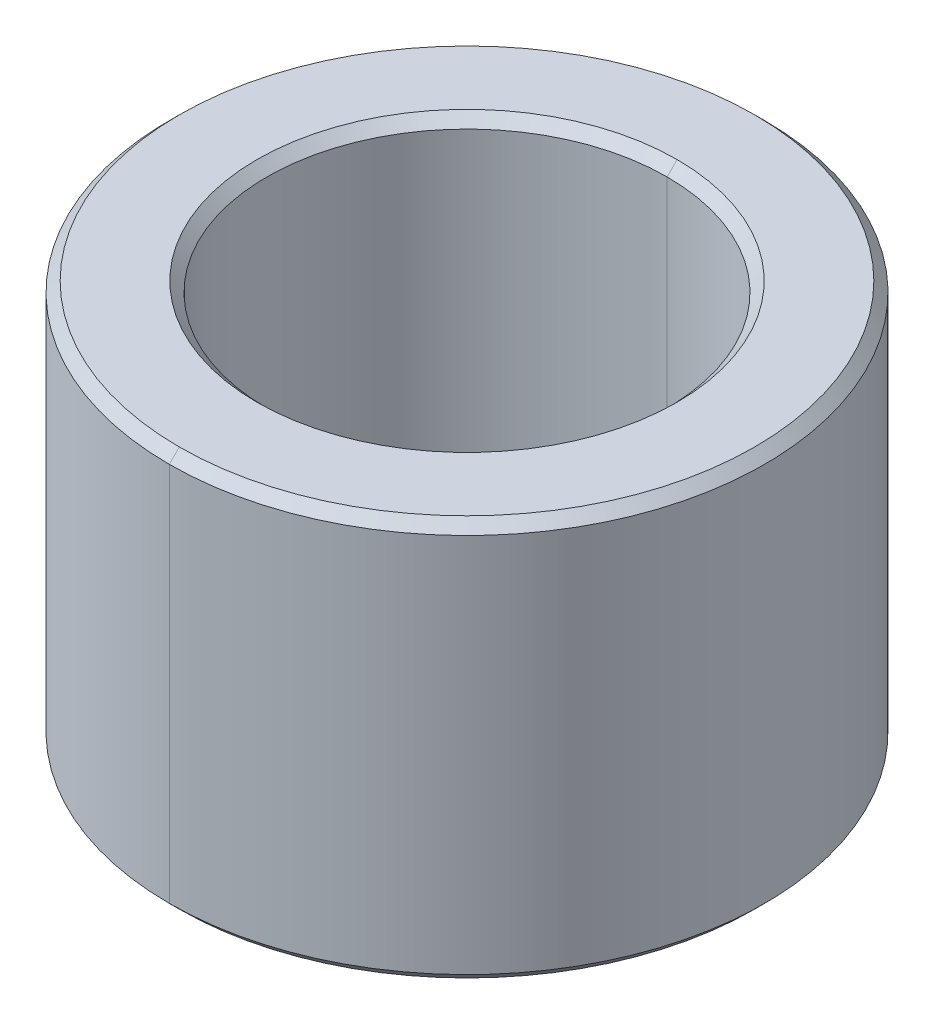
ISO-10303-21;
HEADER;
FILE_DESCRIPTION(('STEP AP214'),'2;1');
FILE_NAME('part.step','',(''),(''),'','','');
FILE_SCHEMA(('AUTOMOTIVE_DESIGN { 1 0 10303 214 1 1 1 1 }'));
ENDSEC;
DATA;
#1=APPLICATION_CONTEXT('core data for automotive mechanical design processes');
#2=APPLICATION_PROTOCOL_DEFINITION('international standard','automotive_design',2000,#1);
#3=PRODUCT_CONTEXT('',#1,'mechanical');
#4=PRODUCT('Part','Part','',(#3));
#5=PRODUCT_RELATED_PRODUCT_CATEGORY('part','',(#4));
#6=PRODUCT_DEFINITION_FORMATION('','',#4);
#7=PRODUCT_DEFINITION_CONTEXT('part definition',#1,'design');
#8=PRODUCT_DEFINITION('design','',#6,#7);
#9=PRODUCT_DEFINITION_SHAPE('','',#8);
#10=(LENGTH_UNIT() NAMED_UNIT(*) SI_UNIT(.MILLI.,.METRE.));
#11=(NAMED_UNIT(*) PLANE_ANGLE_UNIT() SI_UNIT($,.RADIAN.));
#12=(NAMED_UNIT(*) SI_UNIT($,.STERADIAN.) SOLID_ANGLE_UNIT());
#13=UNCERTAINTY_MEASURE_WITH_UNIT(LENGTH_MEASURE(1.E-05),#10,'distance_accuracy_value','');
#14=(GEOMETRIC_REPRESENTATION_CONTEXT(3) GLOBAL_UNCERTAINTY_ASSIGNED_CONTEXT((#13)) GLOBAL_UNIT_ASSIGNED_CONTEXT((#10,
#11,#12)) REPRESENTATION_CONTEXT('',''));
#15=CARTESIAN_POINT('',(0.,0.,0.));
#16=DIRECTION('',(0.,0.,1.));
#17=DIRECTION('',(1.,0.,0.));
#18=AXIS2_PLACEMENT_3D('',#15,#16,#17);
#19=CARTESIAN_POINT('',(0.,1.9,0.));
#20=DIRECTION('',(0.,1.,0.));
#21=DIRECTION('',(0.,0.,1.));
#22=AXIS2_PLACEMENT_3D('',#19,#20,#21);
#23=CONICAL_SURFACE('',#22,2.,0.785398163397455);
#24=DIRECTION('',(0.,0.707106781186543,-0.707106781186552));
#25=VECTOR('',#24,1.);
#26=CARTESIAN_POINT('',(0.,1.9,-2.));
#27=LINE('',#26,#25);
#28=CARTESIAN_POINT('',(0.,1.9,-2.));
#29=VERTEX_POINT('',#28);
#30=CARTESIAN_POINT('',(0.,2.,-2.1));
#31=VERTEX_POINT('',#30);
#32=EDGE_CURVE('E171',#29,#31,#27,.T.);
#33=ORIENTED_EDGE('',*,*,#32,.F.);
#34=CARTESIAN_POINT('',(0.,1.9,0.));
#35=DIRECTION('',(0.,1.,0.));
#36=DIRECTION('',(0.,0.,1.));
#37=AXIS2_PLACEMENT_3D('',#34,#35,#36);
#38=CIRCLE('',#37,2.);
#39=CARTESIAN_POINT('',(0.,1.9,2.));
#40=VERTEX_POINT('',#39);
#41=EDGE_CURVE('E25',#40,#29,#38,.T.);
#42=ORIENTED_EDGE('',*,*,#41,.F.);
#43=DIRECTION('',(0.,0.707106781186543,0.707106781186552));
#44=VECTOR('',#43,1.);
#45=CARTESIAN_POINT('',(0.,1.9,2.));
#46=LINE('',#45,#44);
#47=CARTESIAN_POINT('',(0.,2.,2.1));
#48=VERTEX_POINT('',#47);
#49=EDGE_CURVE('E149',#40,#48,#46,.T.);
#50=ORIENTED_EDGE('',*,*,#49,.T.);
#51=CARTESIAN_POINT('',(0.,2.,0.));
#52=DIRECTION('',(0.,-1.,0.));
#53=DIRECTION('',(0.,0.,1.));
#54=AXIS2_PLACEMENT_3D('',#51,#52,#53);
#55=CIRCLE('',#54,2.1);
#56=EDGE_CURVE('E167',#31,#48,#55,.T.);
#57=ORIENTED_EDGE('',*,*,#56,.F.);
#58=EDGE_LOOP('',(#33,#42,#50,#57));
#59=FACE_BOUND('',#58,.T.);
#60=ADVANCED_FACE('F14',(#59),#23,.F.);
#61=CARTESIAN_POINT('',(0.,-2.,0.));
#62=DIRECTION('',(0.,-1.,0.));
#63=DIRECTION('',(0.,0.,-1.));
#64=AXIS2_PLACEMENT_3D('',#61,#62,#63);
#65=CONICAL_SURFACE('',#64,2.1,0.785398163397443);
#66=DIRECTION('',(0.,-0.707106781186551,0.707106781186545));
#67=VECTOR('',#66,1.);
#68=CARTESIAN_POINT('',(0.,-2.,2.1));
#69=LINE('',#68,#67);
#70=CARTESIAN_POINT('',(0.,-1.9,2.));
#71=VERTEX_POINT('',#70);
#72=CARTESIAN_POINT('',(0.,-2.,2.1));
#73=VERTEX_POINT('',#72);
#74=EDGE_CURVE('E176',#71,#73,#69,.T.);
#75=ORIENTED_EDGE('',*,*,#74,.F.);
#76=CARTESIAN_POINT('',(0.,-1.9,0.));
#77=DIRECTION('',(0.,-1.,0.));
#78=DIRECTION('',(0.,0.,1.));
#79=AXIS2_PLACEMENT_3D('',#76,#77,#78);
#80=CIRCLE('',#79,2.);
#81=CARTESIAN_POINT('',(0.,-1.9,-2.));
#82=VERTEX_POINT('',#81);
#83=EDGE_CURVE('E9',#82,#71,#80,.T.);
#84=ORIENTED_EDGE('',*,*,#83,.F.);
#85=DIRECTION('',(0.,-0.707106781186551,-0.707106781186545));
#86=VECTOR('',#85,1.);
#87=CARTESIAN_POINT('',(0.,-2.,-2.1));
#88=LINE('',#87,#86);
#89=CARTESIAN_POINT('',(0.,-2.,-2.1));
#90=VERTEX_POINT('',#89);
#91=EDGE_CURVE('E141',#82,#90,#88,.T.);
#92=ORIENTED_EDGE('',*,*,#91,.T.);
#93=CARTESIAN_POINT('',(0.,-2.,0.));
#94=DIRECTION('',(0.,1.,0.));
#95=DIRECTION('',(0.,0.,1.));
#96=AXIS2_PLACEMENT_3D('',#93,#94,#95);
#97=CIRCLE('',#96,2.1);
#98=EDGE_CURVE('E116',#73,#90,#97,.T.);
#99=ORIENTED_EDGE('',*,*,#98,.F.);
#100=EDGE_LOOP('',(#75,#84,#92,#99));
#101=FACE_BOUND('',#100,.T.);
#102=ADVANCED_FACE('F219',(#101),#65,.F.);
#103=CARTESIAN_POINT('',(0.,2.,0.));
#104=DIRECTION('',(0.,-1.,0.));
#105=DIRECTION('',(0.,0.,-1.));
#106=AXIS2_PLACEMENT_3D('',#103,#104,#105);
#107=CONICAL_SURFACE('',#106,2.875,0.785398163397452);
#108=DIRECTION('',(0.,-0.707106781186545,0.707106781186551));
#109=VECTOR('',#108,1.);
#110=CARTESIAN_POINT('',(0.,2.,2.875));
#111=LINE('',#110,#109);
#112=CARTESIAN_POINT('',(0.,2.,2.875));
#113=VERTEX_POINT('',#112);
#114=CARTESIAN_POINT('',(0.,1.9,2.975));
#115=VERTEX_POINT('',#114);
#116=EDGE_CURVE('E109',#113,#115,#111,.T.);
#117=ORIENTED_EDGE('',*,*,#116,.F.);
#118=CARTESIAN_POINT('',(0.,2.,0.));
#119=DIRECTION('',(0.,1.,0.));
#120=DIRECTION('',(0.,0.,1.));
#121=AXIS2_PLACEMENT_3D('',#118,#119,#120);
#122=CIRCLE('',#121,2.875);
#123=CARTESIAN_POINT('',(0.,2.,-2.875));
#124=VERTEX_POINT('',#123);
#125=EDGE_CURVE('E148',#124,#113,#122,.T.);
#126=ORIENTED_EDGE('',*,*,#125,.F.);
#127=DIRECTION('',(0.,-0.707106781186545,-0.707106781186551));
#128=VECTOR('',#127,1.);
#129=CARTESIAN_POINT('',(0.,2.,-2.875));
#130=LINE('',#129,#128);
#131=CARTESIAN_POINT('',(0.,1.9,-2.975));
#132=VERTEX_POINT('',#131);
#133=EDGE_CURVE('E112',#124,#132,#130,.T.);
#134=ORIENTED_EDGE('',*,*,#133,.T.);
#135=CARTESIAN_POINT('',(0.,1.9,0.));
#136=DIRECTION('',(0.,-1.,0.));
#137=DIRECTION('',(0.,0.,1.));
#138=AXIS2_PLACEMENT_3D('',#135,#136,#137);
#139=CIRCLE('',#138,2.975);
#140=EDGE_CURVE('E107',#115,#132,#139,.T.);
#141=ORIENTED_EDGE('',*,*,#140,.F.);
#142=EDGE_LOOP('',(#117,#126,#134,#141));
#143=FACE_BOUND('',#142,.T.);
#144=ADVANCED_FACE('F16',(#143),#107,.T.);
#145=CARTESIAN_POINT('',(0.,-1.9,0.));
#146=DIRECTION('',(0.,1.,0.));
#147=DIRECTION('',(0.,0.,1.));
#148=AXIS2_PLACEMENT_3D('',#145,#146,#147);
#149=CONICAL_SURFACE('',#148,2.975,0.78539816339745);
#150=DIRECTION('',(0.,0.707106781186546,-0.707106781186549));
#151=VECTOR('',#150,1.);
#152=CARTESIAN_POINT('',(0.,-1.9,-2.975));
#153=LINE('',#152,#151);
#154=CARTESIAN_POINT('',(0.,-2.,-2.875));
#155=VERTEX_POINT('',#154);
#156=CARTESIAN_POINT('',(0.,-1.9,-2.975));
#157=VERTEX_POINT('',#156);
#158=EDGE_CURVE('E187',#155,#157,#153,.T.);
#159=ORIENTED_EDGE('',*,*,#158,.F.);
#160=CARTESIAN_POINT('',(0.,-2.,0.));
#161=DIRECTION('',(0.,-1.,0.));
#162=DIRECTION('',(0.,0.,1.));
#163=AXIS2_PLACEMENT_3D('',#160,#161,#162);
#164=CIRCLE('',#163,2.875);
#165=CARTESIAN_POINT('',(0.,-2.,2.875));
#166=VERTEX_POINT('',#165);
#167=EDGE_CURVE('E63',#166,#155,#164,.T.);
#168=ORIENTED_EDGE('',*,*,#167,.F.);
#169=DIRECTION('',(0.,0.707106781186546,0.707106781186549));
#170=VECTOR('',#169,1.);
#171=CARTESIAN_POINT('',(0.,-1.9,2.975));
#172=LINE('',#171,#170);
#173=CARTESIAN_POINT('',(0.,-1.9,2.975));
#174=VERTEX_POINT('',#173);
#175=EDGE_CURVE('E157',#166,#174,#172,.T.);
#176=ORIENTED_EDGE('',*,*,#175,.T.);
#177=CARTESIAN_POINT('',(0.,-1.9,0.));
#178=DIRECTION('',(0.,1.,0.));
#179=DIRECTION('',(0.,0.,1.));
#180=AXIS2_PLACEMENT_3D('',#177,#178,#179);
#181=CIRCLE('',#180,2.975);
#182=EDGE_CURVE('E40',#157,#174,#181,.T.);
#183=ORIENTED_EDGE('',*,*,#182,.F.);
#184=EDGE_LOOP('',(#159,#168,#176,#183));
#185=FACE_BOUND('',#184,.T.);
#186=ADVANCED_FACE('F199',(#185),#149,.T.);
#187=CARTESIAN_POINT('',(0.,2.,0.));
#188=DIRECTION('',(0.,-1.,0.));
#189=DIRECTION('',(0.,0.,-1.));
#190=AXIS2_PLACEMENT_3D('',#187,#188,#189);
#191=CYLINDRICAL_SURFACE('',#190,2.);
#192=DIRECTION('',(0.,-1.,0.));
#193=VECTOR('',#192,1.);
#194=CARTESIAN_POINT('',(0.,2.,2.));
#195=LINE('',#194,#193);
#196=EDGE_CURVE('E160',#40,#71,#195,.T.);
#197=ORIENTED_EDGE('',*,*,#196,.F.);
#198=ORIENTED_EDGE('',*,*,#41,.T.);
#199=DIRECTION('',(0.,-1.,0.));
#200=VECTOR('',#199,1.);
#201=CARTESIAN_POINT('',(0.,2.,-2.));
#202=LINE('',#201,#200);
#203=EDGE_CURVE('E18',#29,#82,#202,.T.);
#204=ORIENTED_EDGE('',*,*,#203,.T.);
#205=ORIENTED_EDGE('',*,*,#83,.T.);
#206=EDGE_LOOP('',(#197,#198,#204,#205));
#207=FACE_BOUND('',#206,.T.);
#208=ADVANCED_FACE('F236',(#207),#191,.F.);
#209=CARTESIAN_POINT('',(0.,2.,0.));
#210=DIRECTION('',(0.,-1.,0.));
#211=DIRECTION('',(0.,0.,-1.));
#212=AXIS2_PLACEMENT_3D('',#209,#210,#211);
#213=CYLINDRICAL_SURFACE('',#212,2.975);
#214=DIRECTION('',(0.,-1.,0.));
#215=VECTOR('',#214,1.);
#216=CARTESIAN_POINT('',(0.,2.,2.975));
#217=LINE('',#216,#215);
#218=EDGE_CURVE('E118',#115,#174,#217,.T.);
#219=ORIENTED_EDGE('',*,*,#218,.F.);
#220=ORIENTED_EDGE('',*,*,#140,.T.);
#221=DIRECTION('',(0.,-1.,0.));
#222=VECTOR('',#221,1.);
#223=CARTESIAN_POINT('',(0.,2.,-2.975));
#224=LINE('',#223,#222);
#225=EDGE_CURVE('E124',#132,#157,#224,.T.);
#226=ORIENTED_EDGE('',*,*,#225,.T.);
#227=ORIENTED_EDGE('',*,*,#182,.T.);
#228=EDGE_LOOP('',(#219,#220,#226,#227));
#229=FACE_BOUND('',#228,.T.);
#230=ADVANCED_FACE('F120',(#229),#213,.T.);
#231=CARTESIAN_POINT('',(0.,-2.,0.));
#232=DIRECTION('',(0.,1.,0.));
#233=DIRECTION('',(1.,0.,0.));
#234=AXIS2_PLACEMENT_3D('',#231,#232,#233);
#235=PLANE('',#234);
#236=CARTESIAN_POINT('',(0.,-2.,0.));
#237=DIRECTION('',(0.,1.,0.));
#238=DIRECTION('',(0.,0.,1.));
#239=AXIS2_PLACEMENT_3D('',#236,#237,#238);
#240=CIRCLE('',#239,2.1);
#241=EDGE_CURVE('E207',#90,#73,#240,.T.);
#242=ORIENTED_EDGE('',*,*,#241,.T.);
#243=ORIENTED_EDGE('',*,*,#98,.T.);
#244=EDGE_LOOP('',(#242,#243));
#245=FACE_BOUND('',#244,.T.);
#246=ORIENTED_EDGE('',*,*,#167,.T.);
#247=CARTESIAN_POINT('',(0.,-2.,0.));
#248=DIRECTION('',(0.,-1.,0.));
#249=DIRECTION('',(0.,0.,1.));
#250=AXIS2_PLACEMENT_3D('',#247,#248,#249);
#251=CIRCLE('',#250,2.875);
#252=EDGE_CURVE('E181',#155,#166,#251,.T.);
#253=ORIENTED_EDGE('',*,*,#252,.T.);
#254=EDGE_LOOP('',(#246,#253));
#255=FACE_BOUND('',#254,.T.);
#256=ADVANCED_FACE('F195',(#245,#255),#235,.F.);
#257=CARTESIAN_POINT('',(0.,2.,0.));
#258=DIRECTION('',(0.,1.,0.));
#259=DIRECTION('',(1.,0.,0.));
#260=AXIS2_PLACEMENT_3D('',#257,#258,#259);
#261=PLANE('',#260);
#262=CARTESIAN_POINT('',(0.,2.,0.));
#263=DIRECTION('',(0.,-1.,0.));
#264=DIRECTION('',(0.,0.,1.));
#265=AXIS2_PLACEMENT_3D('',#262,#263,#264);
#266=CIRCLE('',#265,2.1);
#267=EDGE_CURVE('E145',#48,#31,#266,.T.);
#268=ORIENTED_EDGE('',*,*,#267,.T.);
#269=ORIENTED_EDGE('',*,*,#56,.T.);
#270=EDGE_LOOP('',(#268,#269));
#271=FACE_BOUND('',#270,.T.);
#272=ORIENTED_EDGE('',*,*,#125,.T.);
#273=CARTESIAN_POINT('',(0.,2.,0.));
#274=DIRECTION('',(0.,1.,0.));
#275=DIRECTION('',(0.,0.,1.));
#276=AXIS2_PLACEMENT_3D('',#273,#274,#275);
#277=CIRCLE('',#276,2.875);
#278=EDGE_CURVE('E133',#113,#124,#277,.T.);
#279=ORIENTED_EDGE('',*,*,#278,.T.);
#280=EDGE_LOOP('',(#272,#279));
#281=FACE_BOUND('',#280,.T.);
#282=ADVANCED_FACE('F227',(#271,#281),#261,.T.);
#283=CARTESIAN_POINT('',(0.,2.,0.));
#284=DIRECTION('',(0.,-1.,0.));
#285=DIRECTION('',(0.,0.,-1.));
#286=AXIS2_PLACEMENT_3D('',#283,#284,#285);
#287=CYLINDRICAL_SURFACE('',#286,2.975);
#288=CARTESIAN_POINT('',(0.,1.9,0.));
#289=DIRECTION('',(0.,-1.,0.));
#290=DIRECTION('',(0.,0.,1.));
#291=AXIS2_PLACEMENT_3D('',#288,#289,#290);
#292=CIRCLE('',#291,2.975);
#293=EDGE_CURVE('E126',#132,#115,#292,.T.);
#294=ORIENTED_EDGE('',*,*,#293,.T.);
#295=ORIENTED_EDGE('',*,*,#218,.T.);
#296=CARTESIAN_POINT('',(0.,-1.9,0.));
#297=DIRECTION('',(0.,1.,0.));
#298=DIRECTION('',(0.,0.,1.));
#299=AXIS2_PLACEMENT_3D('',#296,#297,#298);
#300=CIRCLE('',#299,2.975);
#301=EDGE_CURVE('E161',#174,#157,#300,.T.);
#302=ORIENTED_EDGE('',*,*,#301,.T.);
#303=ORIENTED_EDGE('',*,*,#225,.F.);
#304=EDGE_LOOP('',(#294,#295,#302,#303));
#305=FACE_BOUND('',#304,.T.);
#306=ADVANCED_FACE('F127',(#305),#287,.T.);
#307=CARTESIAN_POINT('',(0.,2.,0.));
#308=DIRECTION('',(0.,-1.,0.));
#309=DIRECTION('',(0.,0.,-1.));
#310=AXIS2_PLACEMENT_3D('',#307,#308,#309);
#311=CYLINDRICAL_SURFACE('',#310,2.);
#312=CARTESIAN_POINT('',(0.,1.9,0.));
#313=DIRECTION('',(0.,1.,0.));
#314=DIRECTION('',(0.,0.,1.));
#315=AXIS2_PLACEMENT_3D('',#312,#313,#314);
#316=CIRCLE('',#315,2.);
#317=EDGE_CURVE('E168',#29,#40,#316,.T.);
#318=ORIENTED_EDGE('',*,*,#317,.T.);
#319=ORIENTED_EDGE('',*,*,#196,.T.);
#320=CARTESIAN_POINT('',(0.,-1.9,0.));
#321=DIRECTION('',(0.,-1.,0.));
#322=DIRECTION('',(0.,0.,1.));
#323=AXIS2_PLACEMENT_3D('',#320,#321,#322);
#324=CIRCLE('',#323,2.);
#325=EDGE_CURVE('E153',#71,#82,#324,.T.);
#326=ORIENTED_EDGE('',*,*,#325,.T.);
#327=ORIENTED_EDGE('',*,*,#203,.F.);
#328=EDGE_LOOP('',(#318,#319,#326,#327));
#329=FACE_BOUND('',#328,.T.);
#330=ADVANCED_FACE('F258',(#329),#311,.F.);
#331=CARTESIAN_POINT('',(0.,-1.9,0.));
#332=DIRECTION('',(0.,1.,0.));
#333=DIRECTION('',(0.,0.,1.));
#334=AXIS2_PLACEMENT_3D('',#331,#332,#333);
#335=CONICAL_SURFACE('',#334,2.975,0.78539816339745);
#336=ORIENTED_EDGE('',*,*,#252,.F.);
#337=ORIENTED_EDGE('',*,*,#158,.T.);
#338=ORIENTED_EDGE('',*,*,#301,.F.);
#339=ORIENTED_EDGE('',*,*,#175,.F.);
#340=EDGE_LOOP('',(#336,#337,#338,#339));
#341=FACE_BOUND('',#340,.T.);
#342=ADVANCED_FACE('F197',(#341),#335,.T.);
#343=CARTESIAN_POINT('',(0.,2.,0.));
#344=DIRECTION('',(0.,-1.,0.));
#345=DIRECTION('',(0.,0.,-1.));
#346=AXIS2_PLACEMENT_3D('',#343,#344,#345);
#347=CONICAL_SURFACE('',#346,2.875,0.785398163397452);
#348=ORIENTED_EDGE('',*,*,#278,.F.);
#349=ORIENTED_EDGE('',*,*,#116,.T.);
#350=ORIENTED_EDGE('',*,*,#293,.F.);
#351=ORIENTED_EDGE('',*,*,#133,.F.);
#352=EDGE_LOOP('',(#348,#349,#350,#351));
#353=FACE_BOUND('',#352,.T.);
#354=ADVANCED_FACE('F131',(#353),#347,.T.);
#355=CARTESIAN_POINT('',(0.,-2.,0.));
#356=DIRECTION('',(0.,-1.,0.));
#357=DIRECTION('',(0.,0.,-1.));
#358=AXIS2_PLACEMENT_3D('',#355,#356,#357);
#359=CONICAL_SURFACE('',#358,2.1,0.785398163397443);
#360=ORIENTED_EDGE('',*,*,#325,.F.);
#361=ORIENTED_EDGE('',*,*,#74,.T.);
#362=ORIENTED_EDGE('',*,*,#241,.F.);
#363=ORIENTED_EDGE('',*,*,#91,.F.);
#364=EDGE_LOOP('',(#360,#361,#362,#363));
#365=FACE_BOUND('',#364,.T.);
#366=ADVANCED_FACE('F224',(#365),#359,.F.);
#367=CARTESIAN_POINT('',(0.,1.9,0.));
#368=DIRECTION('',(0.,1.,0.));
#369=DIRECTION('',(0.,0.,1.));
#370=AXIS2_PLACEMENT_3D('',#367,#368,#369);
#371=CONICAL_SURFACE('',#370,2.,0.785398163397455);
#372=ORIENTED_EDGE('',*,*,#317,.F.);
#373=ORIENTED_EDGE('',*,*,#32,.T.);
#374=ORIENTED_EDGE('',*,*,#267,.F.);
#375=ORIENTED_EDGE('',*,*,#49,.F.);
#376=EDGE_LOOP('',(#372,#373,#374,#375));
#377=FACE_BOUND('',#376,.T.);
#378=ADVANCED_FACE('F250',(#377),#371,.F.);
#379=CLOSED_SHELL('',(#60,#102,#144,#186,#208,#230,#256,#282,#306,#330,#342,#354,#366,#378));
#380=MANIFOLD_SOLID_BREP('B1',#379);
#381=ADVANCED_BREP_SHAPE_REPRESENTATION('',(#18,#380),#14);
#382=SHAPE_DEFINITION_REPRESENTATION(#9,#381);
ENDSEC;
END-ISO-10303-21;
